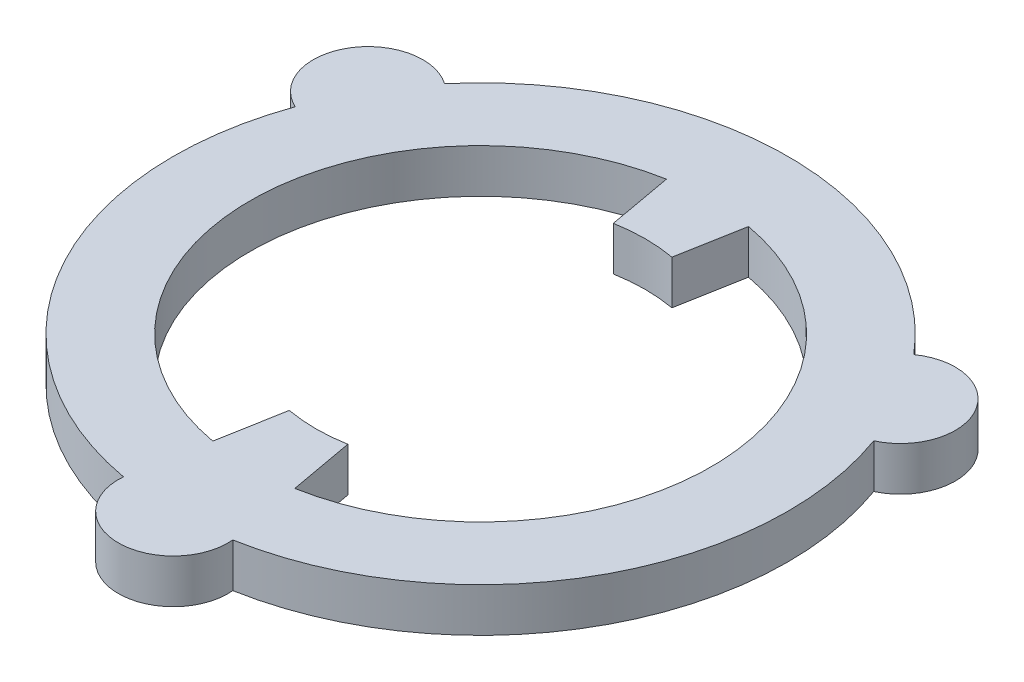
ISO-10303-21;
HEADER;
FILE_DESCRIPTION(('STEP AP214'),'2;1');
FILE_NAME('part.step','',(''),(''),'','','');
FILE_SCHEMA(('AUTOMOTIVE_DESIGN { 1 0 10303 214 1 1 1 1 }'));
ENDSEC;
DATA;
#1=APPLICATION_CONTEXT('core data for automotive mechanical design processes');
#2=APPLICATION_PROTOCOL_DEFINITION('international standard','automotive_design',2000,#1);
#3=PRODUCT_CONTEXT('',#1,'mechanical');
#4=PRODUCT('Part','Part','',(#3));
#5=PRODUCT_RELATED_PRODUCT_CATEGORY('part','',(#4));
#6=PRODUCT_DEFINITION_FORMATION('','',#4);
#7=PRODUCT_DEFINITION_CONTEXT('part definition',#1,'design');
#8=PRODUCT_DEFINITION('design','',#6,#7);
#9=PRODUCT_DEFINITION_SHAPE('','',#8);
#10=(LENGTH_UNIT() NAMED_UNIT(*) SI_UNIT(.MILLI.,.METRE.));
#11=(NAMED_UNIT(*) PLANE_ANGLE_UNIT() SI_UNIT($,.RADIAN.));
#12=(NAMED_UNIT(*) SI_UNIT($,.STERADIAN.) SOLID_ANGLE_UNIT());
#13=UNCERTAINTY_MEASURE_WITH_UNIT(LENGTH_MEASURE(1.E-05),#10,'distance_accuracy_value','');
#14=(GEOMETRIC_REPRESENTATION_CONTEXT(3) GLOBAL_UNCERTAINTY_ASSIGNED_CONTEXT((#13)) GLOBAL_UNIT_ASSIGNED_CONTEXT((#10,
#11,#12)) REPRESENTATION_CONTEXT('',''));
#15=CARTESIAN_POINT('',(0.,0.,0.));
#16=DIRECTION('',(0.,0.,1.));
#17=DIRECTION('',(1.,0.,0.));
#18=AXIS2_PLACEMENT_3D('',#15,#16,#17);
#19=CARTESIAN_POINT('',(0.,2.,7.));
#20=DIRECTION('',(0.,1.,0.));
#21=DIRECTION('',(0.,0.,1.));
#22=AXIS2_PLACEMENT_3D('',#19,#20,#21);
#23=PLANE('',#22);
#24=CARTESIAN_POINT('',(0.,2.,14.));
#25=DIRECTION('',(0.,1.,0.));
#26=DIRECTION('',(0.,0.,1.));
#27=AXIS2_PLACEMENT_3D('',#24,#25,#26);
#28=CIRCLE('',#27,2.5);
#29=CARTESIAN_POINT('',(-2.49001513703292,2.,13.7767857142857));
#30=VERTEX_POINT('',#29);
#31=CARTESIAN_POINT('',(2.49001513703292,2.,13.7767857142857));
#32=VERTEX_POINT('',#31);
#33=EDGE_CURVE('E199',#30,#32,#28,.T.);
#34=ORIENTED_EDGE('',*,*,#33,.T.);
#35=CARTESIAN_POINT('',(0.,2.,0.));
#36=DIRECTION('',(0.,1.,0.));
#37=DIRECTION('',(0.,0.,1.));
#38=AXIS2_PLACEMENT_3D('',#35,#36,#37);
#39=CIRCLE('',#38,14.);
#40=CARTESIAN_POINT('',(13.1760539795824,2.,-4.73197649266453));
#41=VERTEX_POINT('',#40);
#42=EDGE_CURVE('E202',#32,#41,#39,.T.);
#43=ORIENTED_EDGE('',*,*,#42,.T.);
#44=CARTESIAN_POINT('',(12.1243556529822,2.,-6.99999999999997));
#45=DIRECTION('',(0.,1.,0.));
#46=DIRECTION('',(0.,0.,1.));
#47=AXIS2_PLACEMENT_3D('',#44,#45,#46);
#48=CIRCLE('',#47,2.5);
#49=CARTESIAN_POINT('',(10.6860388425495,2.,-9.04480922162113));
#50=VERTEX_POINT('',#49);
#51=EDGE_CURVE('E205',#41,#50,#48,.T.);
#52=ORIENTED_EDGE('',*,*,#51,.T.);
#53=CARTESIAN_POINT('',(0.,2.,0.));
#54=DIRECTION('',(0.,1.,0.));
#55=DIRECTION('',(0.,0.,1.));
#56=AXIS2_PLACEMENT_3D('',#53,#54,#55);
#57=CIRCLE('',#56,14.);
#58=CARTESIAN_POINT('',(-10.6860388425495,2.,-9.04480922162113));
#59=VERTEX_POINT('',#58);
#60=EDGE_CURVE('E207',#50,#59,#57,.T.);
#61=ORIENTED_EDGE('',*,*,#60,.T.);
#62=CARTESIAN_POINT('',(-12.1243556529822,2.,-6.99999999999999));
#63=DIRECTION('',(0.,1.,0.));
#64=DIRECTION('',(0.,0.,1.));
#65=AXIS2_PLACEMENT_3D('',#62,#63,#64);
#66=CIRCLE('',#65,2.5);
#67=CARTESIAN_POINT('',(-13.1760539795824,2.,-4.73197649266453));
#68=VERTEX_POINT('',#67);
#69=EDGE_CURVE('E209',#59,#68,#66,.T.);
#70=ORIENTED_EDGE('',*,*,#69,.T.);
#71=CARTESIAN_POINT('',(0.,2.,0.));
#72=DIRECTION('',(0.,1.,0.));
#73=DIRECTION('',(0.,0.,1.));
#74=AXIS2_PLACEMENT_3D('',#71,#72,#73);
#75=CIRCLE('',#74,14.);
#76=EDGE_CURVE('E211',#68,#30,#75,.T.);
#77=ORIENTED_EDGE('',*,*,#76,.T.);
#78=EDGE_LOOP('',(#34,#43,#52,#61,#70,#77));
#79=FACE_BOUND('',#78,.T.);
#80=DIRECTION('',(0.17785822407378,0.,-0.98405612244898));
#81=VECTOR('',#80,1.);
#82=CARTESIAN_POINT('',(-1.33393668055335,2.,7.38042091836735));
#83=LINE('',#82,#81);
#84=CARTESIAN_POINT('',(-1.86751135277469,2.,10.3325892857143));
#85=VERTEX_POINT('',#84);
#86=CARTESIAN_POINT('',(-1.33393668055335,2.,7.38042091836735));
#87=VERTEX_POINT('',#86);
#88=EDGE_CURVE('E142',#85,#87,#83,.T.);
#89=ORIENTED_EDGE('',*,*,#88,.F.);
#90=CARTESIAN_POINT('',(0.,2.,0.));
#91=DIRECTION('',(0.,1.,0.));
#92=DIRECTION('',(0.,0.,1.));
#93=AXIS2_PLACEMENT_3D('',#90,#91,#92);
#94=CIRCLE('',#93,10.5);
#95=CARTESIAN_POINT('',(-1.86751135277469,2.,-10.3325892857143));
#96=VERTEX_POINT('',#95);
#97=EDGE_CURVE('E134',#96,#85,#94,.T.);
#98=ORIENTED_EDGE('',*,*,#97,.F.);
#99=DIRECTION('',(-0.17785822407378,0.,-0.98405612244898));
#100=VECTOR('',#99,1.);
#101=CARTESIAN_POINT('',(-1.86751135277469,2.,-10.3325892857143));
#102=LINE('',#101,#100);
#103=CARTESIAN_POINT('',(-1.33393668055335,2.,-7.38042091836735));
#104=VERTEX_POINT('',#103);
#105=EDGE_CURVE('E167',#104,#96,#102,.T.);
#106=ORIENTED_EDGE('',*,*,#105,.F.);
#107=CARTESIAN_POINT('',(0.,2.,0.));
#108=DIRECTION('',(0.,1.,0.));
#109=DIRECTION('',(0.,0.,1.));
#110=AXIS2_PLACEMENT_3D('',#107,#108,#109);
#111=CIRCLE('',#110,7.5);
#112=CARTESIAN_POINT('',(1.33393668055335,2.,-7.38042091836735));
#113=VERTEX_POINT('',#112);
#114=EDGE_CURVE('E165',#113,#104,#111,.T.);
#115=ORIENTED_EDGE('',*,*,#114,.F.);
#116=DIRECTION('',(-0.17785822407378,0.,0.98405612244898));
#117=VECTOR('',#116,1.);
#118=CARTESIAN_POINT('',(1.33393668055335,2.,-7.38042091836735));
#119=LINE('',#118,#117);
#120=CARTESIAN_POINT('',(1.86751135277469,2.,-10.3325892857143));
#121=VERTEX_POINT('',#120);
#122=EDGE_CURVE('E163',#121,#113,#119,.T.);
#123=ORIENTED_EDGE('',*,*,#122,.F.);
#124=CARTESIAN_POINT('',(0.,2.,0.));
#125=DIRECTION('',(0.,1.,0.));
#126=DIRECTION('',(0.,0.,1.));
#127=AXIS2_PLACEMENT_3D('',#124,#125,#126);
#128=CIRCLE('',#127,10.5);
#129=CARTESIAN_POINT('',(1.86751135277469,2.,10.3325892857143));
#130=VERTEX_POINT('',#129);
#131=EDGE_CURVE('E161',#130,#121,#128,.T.);
#132=ORIENTED_EDGE('',*,*,#131,.F.);
#133=DIRECTION('',(0.17785822407378,0.,0.98405612244898));
#134=VECTOR('',#133,1.);
#135=CARTESIAN_POINT('',(1.86751135277469,2.,10.3325892857143));
#136=LINE('',#135,#134);
#137=CARTESIAN_POINT('',(1.33393668055335,2.,7.38042091836735));
#138=VERTEX_POINT('',#137);
#139=EDGE_CURVE('E157',#138,#130,#136,.T.);
#140=ORIENTED_EDGE('',*,*,#139,.F.);
#141=CARTESIAN_POINT('',(0.,2.,0.));
#142=DIRECTION('',(0.,1.,0.));
#143=DIRECTION('',(0.,0.,1.));
#144=AXIS2_PLACEMENT_3D('',#141,#142,#143);
#145=CIRCLE('',#144,7.5);
#146=EDGE_CURVE('E155',#87,#138,#145,.T.);
#147=ORIENTED_EDGE('',*,*,#146,.F.);
#148=EDGE_LOOP('',(#89,#98,#106,#115,#123,#132,#140,#147));
#149=FACE_BOUND('',#148,.T.);
#150=ADVANCED_FACE('F33',(#79,#149),#23,.T.);
#151=CARTESIAN_POINT('',(0.,0.,7.));
#152=DIRECTION('',(0.,1.,0.));
#153=DIRECTION('',(0.,0.,1.));
#154=AXIS2_PLACEMENT_3D('',#151,#152,#153);
#155=PLANE('',#154);
#156=CARTESIAN_POINT('',(0.,0.,14.));
#157=DIRECTION('',(0.,1.,0.));
#158=DIRECTION('',(0.,0.,1.));
#159=AXIS2_PLACEMENT_3D('',#156,#157,#158);
#160=CIRCLE('',#159,2.5);
#161=CARTESIAN_POINT('',(-2.49001513703292,0.,13.7767857142857));
#162=VERTEX_POINT('',#161);
#163=CARTESIAN_POINT('',(2.49001513703292,0.,13.7767857142857));
#164=VERTEX_POINT('',#163);
#165=EDGE_CURVE('E150',#162,#164,#160,.T.);
#166=ORIENTED_EDGE('',*,*,#165,.F.);
#167=CARTESIAN_POINT('',(0.,0.,0.));
#168=DIRECTION('',(0.,1.,0.));
#169=DIRECTION('',(0.,0.,1.));
#170=AXIS2_PLACEMENT_3D('',#167,#168,#169);
#171=CIRCLE('',#170,14.);
#172=CARTESIAN_POINT('',(-13.1760539795824,0.,-4.73197649266453));
#173=VERTEX_POINT('',#172);
#174=EDGE_CURVE('E203',#173,#162,#171,.T.);
#175=ORIENTED_EDGE('',*,*,#174,.F.);
#176=CARTESIAN_POINT('',(-12.1243556529822,0.,-6.99999999999999));
#177=DIRECTION('',(0.,1.,0.));
#178=DIRECTION('',(0.,0.,1.));
#179=AXIS2_PLACEMENT_3D('',#176,#177,#178);
#180=CIRCLE('',#179,2.5);
#181=CARTESIAN_POINT('',(-10.6860388425495,0.,-9.04480922162113));
#182=VERTEX_POINT('',#181);
#183=EDGE_CURVE('E222',#182,#173,#180,.T.);
#184=ORIENTED_EDGE('',*,*,#183,.F.);
#185=CARTESIAN_POINT('',(0.,0.,0.));
#186=DIRECTION('',(0.,1.,0.));
#187=DIRECTION('',(0.,0.,1.));
#188=AXIS2_PLACEMENT_3D('',#185,#186,#187);
#189=CIRCLE('',#188,14.);
#190=CARTESIAN_POINT('',(10.6860388425495,0.,-9.04480922162113));
#191=VERTEX_POINT('',#190);
#192=EDGE_CURVE('E220',#191,#182,#189,.T.);
#193=ORIENTED_EDGE('',*,*,#192,.F.);
#194=CARTESIAN_POINT('',(12.1243556529822,0.,-6.99999999999997));
#195=DIRECTION('',(0.,1.,0.));
#196=DIRECTION('',(0.,0.,1.));
#197=AXIS2_PLACEMENT_3D('',#194,#195,#196);
#198=CIRCLE('',#197,2.5);
#199=CARTESIAN_POINT('',(13.1760539795824,0.,-4.73197649266453));
#200=VERTEX_POINT('',#199);
#201=EDGE_CURVE('E218',#200,#191,#198,.T.);
#202=ORIENTED_EDGE('',*,*,#201,.F.);
#203=CARTESIAN_POINT('',(0.,0.,0.));
#204=DIRECTION('',(0.,1.,0.));
#205=DIRECTION('',(0.,0.,1.));
#206=AXIS2_PLACEMENT_3D('',#203,#204,#205);
#207=CIRCLE('',#206,14.);
#208=EDGE_CURVE('E216',#164,#200,#207,.T.);
#209=ORIENTED_EDGE('',*,*,#208,.F.);
#210=EDGE_LOOP('',(#166,#175,#184,#193,#202,#209));
#211=FACE_BOUND('',#210,.T.);
#212=CARTESIAN_POINT('',(0.,0.,0.));
#213=DIRECTION('',(0.,1.,0.));
#214=DIRECTION('',(0.,0.,1.));
#215=AXIS2_PLACEMENT_3D('',#212,#213,#214);
#216=CIRCLE('',#215,10.5);
#217=CARTESIAN_POINT('',(-1.86751135277469,0.,-10.3325892857143));
#218=VERTEX_POINT('',#217);
#219=CARTESIAN_POINT('',(-1.86751135277469,0.,10.3325892857143));
#220=VERTEX_POINT('',#219);
#221=EDGE_CURVE('E56',#218,#220,#216,.T.);
#222=ORIENTED_EDGE('',*,*,#221,.T.);
#223=DIRECTION('',(0.17785822407378,0.,-0.98405612244898));
#224=VECTOR('',#223,1.);
#225=CARTESIAN_POINT('',(-1.33393668055335,0.,7.38042091836735));
#226=LINE('',#225,#224);
#227=CARTESIAN_POINT('',(-1.33393668055335,0.,7.38042091836735));
#228=VERTEX_POINT('',#227);
#229=EDGE_CURVE('E149',#220,#228,#226,.T.);
#230=ORIENTED_EDGE('',*,*,#229,.T.);
#231=CARTESIAN_POINT('',(0.,0.,0.));
#232=DIRECTION('',(0.,1.,0.));
#233=DIRECTION('',(0.,0.,1.));
#234=AXIS2_PLACEMENT_3D('',#231,#232,#233);
#235=CIRCLE('',#234,7.5);
#236=CARTESIAN_POINT('',(1.33393668055335,0.,7.38042091836735));
#237=VERTEX_POINT('',#236);
#238=EDGE_CURVE('E171',#228,#237,#235,.T.);
#239=ORIENTED_EDGE('',*,*,#238,.T.);
#240=DIRECTION('',(0.17785822407378,0.,0.98405612244898));
#241=VECTOR('',#240,1.);
#242=CARTESIAN_POINT('',(1.86751135277469,0.,10.3325892857143));
#243=LINE('',#242,#241);
#244=CARTESIAN_POINT('',(1.86751135277469,0.,10.3325892857143));
#245=VERTEX_POINT('',#244);
#246=EDGE_CURVE('E174',#237,#245,#243,.T.);
#247=ORIENTED_EDGE('',*,*,#246,.T.);
#248=CARTESIAN_POINT('',(0.,0.,0.));
#249=DIRECTION('',(0.,1.,0.));
#250=DIRECTION('',(0.,0.,1.));
#251=AXIS2_PLACEMENT_3D('',#248,#249,#250);
#252=CIRCLE('',#251,10.5);
#253=CARTESIAN_POINT('',(1.86751135277469,0.,-10.3325892857143));
#254=VERTEX_POINT('',#253);
#255=EDGE_CURVE('E177',#245,#254,#252,.T.);
#256=ORIENTED_EDGE('',*,*,#255,.T.);
#257=DIRECTION('',(-0.17785822407378,0.,0.98405612244898));
#258=VECTOR('',#257,1.);
#259=CARTESIAN_POINT('',(1.33393668055335,0.,-7.38042091836735));
#260=LINE('',#259,#258);
#261=CARTESIAN_POINT('',(1.33393668055335,0.,-7.38042091836735));
#262=VERTEX_POINT('',#261);
#263=EDGE_CURVE('E180',#254,#262,#260,.T.);
#264=ORIENTED_EDGE('',*,*,#263,.T.);
#265=CARTESIAN_POINT('',(0.,0.,0.));
#266=DIRECTION('',(0.,1.,0.));
#267=DIRECTION('',(0.,0.,1.));
#268=AXIS2_PLACEMENT_3D('',#265,#266,#267);
#269=CIRCLE('',#268,7.5);
#270=CARTESIAN_POINT('',(-1.33393668055335,0.,-7.38042091836735));
#271=VERTEX_POINT('',#270);
#272=EDGE_CURVE('E183',#262,#271,#269,.T.);
#273=ORIENTED_EDGE('',*,*,#272,.T.);
#274=DIRECTION('',(-0.17785822407378,0.,-0.98405612244898));
#275=VECTOR('',#274,1.);
#276=CARTESIAN_POINT('',(-1.86751135277469,0.,-10.3325892857143));
#277=LINE('',#276,#275);
#278=EDGE_CURVE('E143',#271,#218,#277,.T.);
#279=ORIENTED_EDGE('',*,*,#278,.T.);
#280=EDGE_LOOP('',(#222,#230,#239,#247,#256,#264,#273,#279));
#281=FACE_BOUND('',#280,.T.);
#282=ADVANCED_FACE('F246',(#211,#281),#155,.F.);
#283=CARTESIAN_POINT('',(0.,2.,14.));
#284=DIRECTION('',(0.,-1.,0.));
#285=DIRECTION('',(0.,0.,-1.));
#286=AXIS2_PLACEMENT_3D('',#283,#284,#285);
#287=CYLINDRICAL_SURFACE('',#286,2.5);
#288=ORIENTED_EDGE('',*,*,#165,.T.);
#289=DIRECTION('',(0.,-1.,0.));
#290=VECTOR('',#289,1.);
#291=CARTESIAN_POINT('',(2.49001513703292,2.,13.7767857142857));
#292=LINE('',#291,#290);
#293=EDGE_CURVE('E11',#32,#164,#292,.T.);
#294=ORIENTED_EDGE('',*,*,#293,.F.);
#295=ORIENTED_EDGE('',*,*,#33,.F.);
#296=DIRECTION('',(0.,-1.,0.));
#297=VECTOR('',#296,1.);
#298=CARTESIAN_POINT('',(-2.49001513703292,2.,13.7767857142857));
#299=LINE('',#298,#297);
#300=EDGE_CURVE('E213',#30,#162,#299,.T.);
#301=ORIENTED_EDGE('',*,*,#300,.T.);
#302=EDGE_LOOP('',(#288,#294,#295,#301));
#303=FACE_BOUND('',#302,.T.);
#304=ADVANCED_FACE('F35',(#303),#287,.T.);
#305=CARTESIAN_POINT('',(0.,2.,0.));
#306=DIRECTION('',(0.,-1.,0.));
#307=DIRECTION('',(0.,0.,-1.));
#308=AXIS2_PLACEMENT_3D('',#305,#306,#307);
#309=CYLINDRICAL_SURFACE('',#308,14.);
#310=ORIENTED_EDGE('',*,*,#208,.T.);
#311=DIRECTION('',(0.,-1.,0.));
#312=VECTOR('',#311,1.);
#313=CARTESIAN_POINT('',(13.1760539795824,2.,-4.73197649266453));
#314=LINE('',#313,#312);
#315=EDGE_CURVE('E41',#41,#200,#314,.T.);
#316=ORIENTED_EDGE('',*,*,#315,.F.);
#317=ORIENTED_EDGE('',*,*,#42,.F.);
#318=ORIENTED_EDGE('',*,*,#293,.T.);
#319=EDGE_LOOP('',(#310,#316,#317,#318));
#320=FACE_BOUND('',#319,.T.);
#321=ADVANCED_FACE('F263',(#320),#309,.T.);
#322=CARTESIAN_POINT('',(12.1243556529822,2.,-6.99999999999997));
#323=DIRECTION('',(0.,-1.,0.));
#324=DIRECTION('',(0.,0.,-1.));
#325=AXIS2_PLACEMENT_3D('',#322,#323,#324);
#326=CYLINDRICAL_SURFACE('',#325,2.5);
#327=ORIENTED_EDGE('',*,*,#201,.T.);
#328=DIRECTION('',(0.,-1.,0.));
#329=VECTOR('',#328,1.);
#330=CARTESIAN_POINT('',(10.6860388425495,2.,-9.04480922162113));
#331=LINE('',#330,#329);
#332=EDGE_CURVE('E233',#50,#191,#331,.T.);
#333=ORIENTED_EDGE('',*,*,#332,.F.);
#334=ORIENTED_EDGE('',*,*,#51,.F.);
#335=ORIENTED_EDGE('',*,*,#315,.T.);
#336=EDGE_LOOP('',(#327,#333,#334,#335));
#337=FACE_BOUND('',#336,.T.);
#338=ADVANCED_FACE('F240',(#337),#326,.T.);
#339=CARTESIAN_POINT('',(0.,2.,0.));
#340=DIRECTION('',(0.,-1.,0.));
#341=DIRECTION('',(0.,0.,-1.));
#342=AXIS2_PLACEMENT_3D('',#339,#340,#341);
#343=CYLINDRICAL_SURFACE('',#342,14.);
#344=ORIENTED_EDGE('',*,*,#192,.T.);
#345=DIRECTION('',(0.,-1.,0.));
#346=VECTOR('',#345,1.);
#347=CARTESIAN_POINT('',(-10.6860388425495,2.,-9.04480922162113));
#348=LINE('',#347,#346);
#349=EDGE_CURVE('E230',#59,#182,#348,.T.);
#350=ORIENTED_EDGE('',*,*,#349,.F.);
#351=ORIENTED_EDGE('',*,*,#60,.F.);
#352=ORIENTED_EDGE('',*,*,#332,.T.);
#353=EDGE_LOOP('',(#344,#350,#351,#352));
#354=FACE_BOUND('',#353,.T.);
#355=ADVANCED_FACE('F252',(#354),#343,.T.);
#356=CARTESIAN_POINT('',(-12.1243556529822,2.,-6.99999999999999));
#357=DIRECTION('',(0.,-1.,0.));
#358=DIRECTION('',(0.,0.,-1.));
#359=AXIS2_PLACEMENT_3D('',#356,#357,#358);
#360=CYLINDRICAL_SURFACE('',#359,2.5);
#361=ORIENTED_EDGE('',*,*,#183,.T.);
#362=DIRECTION('',(0.,-1.,0.));
#363=VECTOR('',#362,1.);
#364=CARTESIAN_POINT('',(-13.1760539795824,2.,-4.73197649266453));
#365=LINE('',#364,#363);
#366=EDGE_CURVE('E227',#68,#173,#365,.T.);
#367=ORIENTED_EDGE('',*,*,#366,.F.);
#368=ORIENTED_EDGE('',*,*,#69,.F.);
#369=ORIENTED_EDGE('',*,*,#349,.T.);
#370=EDGE_LOOP('',(#361,#367,#368,#369));
#371=FACE_BOUND('',#370,.T.);
#372=ADVANCED_FACE('F256',(#371),#360,.T.);
#373=CARTESIAN_POINT('',(0.,2.,0.));
#374=DIRECTION('',(0.,-1.,0.));
#375=DIRECTION('',(0.,0.,-1.));
#376=AXIS2_PLACEMENT_3D('',#373,#374,#375);
#377=CYLINDRICAL_SURFACE('',#376,14.);
#378=ORIENTED_EDGE('',*,*,#174,.T.);
#379=ORIENTED_EDGE('',*,*,#300,.F.);
#380=ORIENTED_EDGE('',*,*,#76,.F.);
#381=ORIENTED_EDGE('',*,*,#366,.T.);
#382=EDGE_LOOP('',(#378,#379,#380,#381));
#383=FACE_BOUND('',#382,.T.);
#384=ADVANCED_FACE('F266',(#383),#377,.T.);
#385=CARTESIAN_POINT('',(0.,2.,0.));
#386=DIRECTION('',(0.,-1.,0.));
#387=DIRECTION('',(0.,0.,-1.));
#388=AXIS2_PLACEMENT_3D('',#385,#386,#387);
#389=CYLINDRICAL_SURFACE('',#388,10.5);
#390=ORIENTED_EDGE('',*,*,#221,.F.);
#391=DIRECTION('',(0.,-1.,0.));
#392=VECTOR('',#391,1.);
#393=CARTESIAN_POINT('',(-1.86751135277469,2.,-10.3325892857143));
#394=LINE('',#393,#392);
#395=EDGE_CURVE('E138',#96,#218,#394,.T.);
#396=ORIENTED_EDGE('',*,*,#395,.F.);
#397=ORIENTED_EDGE('',*,*,#97,.T.);
#398=DIRECTION('',(0.,-1.,0.));
#399=VECTOR('',#398,1.);
#400=CARTESIAN_POINT('',(-1.86751135277469,2.,10.3325892857143));
#401=LINE('',#400,#399);
#402=EDGE_CURVE('E137',#85,#220,#401,.T.);
#403=ORIENTED_EDGE('',*,*,#402,.T.);
#404=EDGE_LOOP('',(#390,#396,#397,#403));
#405=FACE_BOUND('',#404,.T.);
#406=ADVANCED_FACE('F136',(#405),#389,.F.);
#407=CARTESIAN_POINT('',(-1.33393668055335,2.,7.38042091836735));
#408=DIRECTION('',(-0.98405612244898,0.,-0.17785822407378));
#409=DIRECTION('',(-0.17785822407378,0.,0.98405612244898));
#410=AXIS2_PLACEMENT_3D('',#407,#408,#409);
#411=PLANE('',#410);
#412=ORIENTED_EDGE('',*,*,#229,.F.);
#413=ORIENTED_EDGE('',*,*,#402,.F.);
#414=ORIENTED_EDGE('',*,*,#88,.T.);
#415=DIRECTION('',(0.,-1.,0.));
#416=VECTOR('',#415,1.);
#417=CARTESIAN_POINT('',(-1.33393668055335,2.,7.38042091836735));
#418=LINE('',#417,#416);
#419=EDGE_CURVE('E151',#87,#228,#418,.T.);
#420=ORIENTED_EDGE('',*,*,#419,.T.);
#421=EDGE_LOOP('',(#412,#413,#414,#420));
#422=FACE_BOUND('',#421,.T.);
#423=ADVANCED_FACE('F146',(#422),#411,.T.);
#424=CARTESIAN_POINT('',(0.,2.,0.));
#425=DIRECTION('',(0.,-1.,0.));
#426=DIRECTION('',(0.,0.,-1.));
#427=AXIS2_PLACEMENT_3D('',#424,#425,#426);
#428=CYLINDRICAL_SURFACE('',#427,7.5);
#429=ORIENTED_EDGE('',*,*,#238,.F.);
#430=ORIENTED_EDGE('',*,*,#419,.F.);
#431=ORIENTED_EDGE('',*,*,#146,.T.);
#432=DIRECTION('',(0.,-1.,0.));
#433=VECTOR('',#432,1.);
#434=CARTESIAN_POINT('',(1.33393668055335,2.,7.38042091836735));
#435=LINE('',#434,#433);
#436=EDGE_CURVE('E196',#138,#237,#435,.T.);
#437=ORIENTED_EDGE('',*,*,#436,.T.);
#438=EDGE_LOOP('',(#429,#430,#431,#437));
#439=FACE_BOUND('',#438,.T.);
#440=ADVANCED_FACE('F284',(#439),#428,.F.);
#441=CARTESIAN_POINT('',(1.86751135277469,2.,10.3325892857143));
#442=DIRECTION('',(0.98405612244898,0.,-0.17785822407378));
#443=DIRECTION('',(-0.17785822407378,0.,-0.98405612244898));
#444=AXIS2_PLACEMENT_3D('',#441,#442,#443);
#445=PLANE('',#444);
#446=ORIENTED_EDGE('',*,*,#246,.F.);
#447=ORIENTED_EDGE('',*,*,#436,.F.);
#448=ORIENTED_EDGE('',*,*,#139,.T.);
#449=DIRECTION('',(0.,-1.,0.));
#450=VECTOR('',#449,1.);
#451=CARTESIAN_POINT('',(1.86751135277469,2.,10.3325892857143));
#452=LINE('',#451,#450);
#453=EDGE_CURVE('E194',#130,#245,#452,.T.);
#454=ORIENTED_EDGE('',*,*,#453,.T.);
#455=EDGE_LOOP('',(#446,#447,#448,#454));
#456=FACE_BOUND('',#455,.T.);
#457=ADVANCED_FACE('F287',(#456),#445,.T.);
#458=CARTESIAN_POINT('',(0.,2.,0.));
#459=DIRECTION('',(0.,-1.,0.));
#460=DIRECTION('',(0.,0.,-1.));
#461=AXIS2_PLACEMENT_3D('',#458,#459,#460);
#462=CYLINDRICAL_SURFACE('',#461,10.5);
#463=ORIENTED_EDGE('',*,*,#255,.F.);
#464=ORIENTED_EDGE('',*,*,#453,.F.);
#465=ORIENTED_EDGE('',*,*,#131,.T.);
#466=DIRECTION('',(0.,-1.,0.));
#467=VECTOR('',#466,1.);
#468=CARTESIAN_POINT('',(1.86751135277469,2.,-10.3325892857143));
#469=LINE('',#468,#467);
#470=EDGE_CURVE('E192',#121,#254,#469,.T.);
#471=ORIENTED_EDGE('',*,*,#470,.T.);
#472=EDGE_LOOP('',(#463,#464,#465,#471));
#473=FACE_BOUND('',#472,.T.);
#474=ADVANCED_FACE('F291',(#473),#462,.F.);
#475=CARTESIAN_POINT('',(1.33393668055335,2.,-7.38042091836735));
#476=DIRECTION('',(0.98405612244898,0.,0.17785822407378));
#477=DIRECTION('',(0.17785822407378,0.,-0.98405612244898));
#478=AXIS2_PLACEMENT_3D('',#475,#476,#477);
#479=PLANE('',#478);
#480=ORIENTED_EDGE('',*,*,#263,.F.);
#481=ORIENTED_EDGE('',*,*,#470,.F.);
#482=ORIENTED_EDGE('',*,*,#122,.T.);
#483=DIRECTION('',(0.,-1.,0.));
#484=VECTOR('',#483,1.);
#485=CARTESIAN_POINT('',(1.33393668055335,2.,-7.38042091836735));
#486=LINE('',#485,#484);
#487=EDGE_CURVE('E190',#113,#262,#486,.T.);
#488=ORIENTED_EDGE('',*,*,#487,.T.);
#489=EDGE_LOOP('',(#480,#481,#482,#488));
#490=FACE_BOUND('',#489,.T.);
#491=ADVANCED_FACE('F295',(#490),#479,.T.);
#492=CARTESIAN_POINT('',(0.,2.,0.));
#493=DIRECTION('',(0.,-1.,0.));
#494=DIRECTION('',(0.,0.,-1.));
#495=AXIS2_PLACEMENT_3D('',#492,#493,#494);
#496=CYLINDRICAL_SURFACE('',#495,7.5);
#497=ORIENTED_EDGE('',*,*,#272,.F.);
#498=ORIENTED_EDGE('',*,*,#487,.F.);
#499=ORIENTED_EDGE('',*,*,#114,.T.);
#500=DIRECTION('',(0.,-1.,0.));
#501=VECTOR('',#500,1.);
#502=CARTESIAN_POINT('',(-1.33393668055335,2.,-7.38042091836735));
#503=LINE('',#502,#501);
#504=EDGE_CURVE('E48',#104,#271,#503,.T.);
#505=ORIENTED_EDGE('',*,*,#504,.T.);
#506=EDGE_LOOP('',(#497,#498,#499,#505));
#507=FACE_BOUND('',#506,.T.);
#508=ADVANCED_FACE('F299',(#507),#496,.F.);
#509=CARTESIAN_POINT('',(-1.86751135277469,2.,-10.3325892857143));
#510=DIRECTION('',(-0.98405612244898,0.,0.17785822407378));
#511=DIRECTION('',(0.17785822407378,0.,0.98405612244898));
#512=AXIS2_PLACEMENT_3D('',#509,#510,#511);
#513=PLANE('',#512);
#514=ORIENTED_EDGE('',*,*,#278,.F.);
#515=ORIENTED_EDGE('',*,*,#504,.F.);
#516=ORIENTED_EDGE('',*,*,#105,.T.);
#517=ORIENTED_EDGE('',*,*,#395,.T.);
#518=EDGE_LOOP('',(#514,#515,#516,#517));
#519=FACE_BOUND('',#518,.T.);
#520=ADVANCED_FACE('F303',(#519),#513,.T.);
#521=CLOSED_SHELL('',(#150,#282,#304,#321,#338,#355,#372,#384,#406,#423,#440,#457,#474,#491,
#508,#520));
#522=MANIFOLD_SOLID_BREP('B2',#521);
#523=ADVANCED_BREP_SHAPE_REPRESENTATION('',(#18,#522),#14);
#524=SHAPE_DEFINITION_REPRESENTATION(#9,#523);
ENDSEC;
END-ISO-10303-21;
